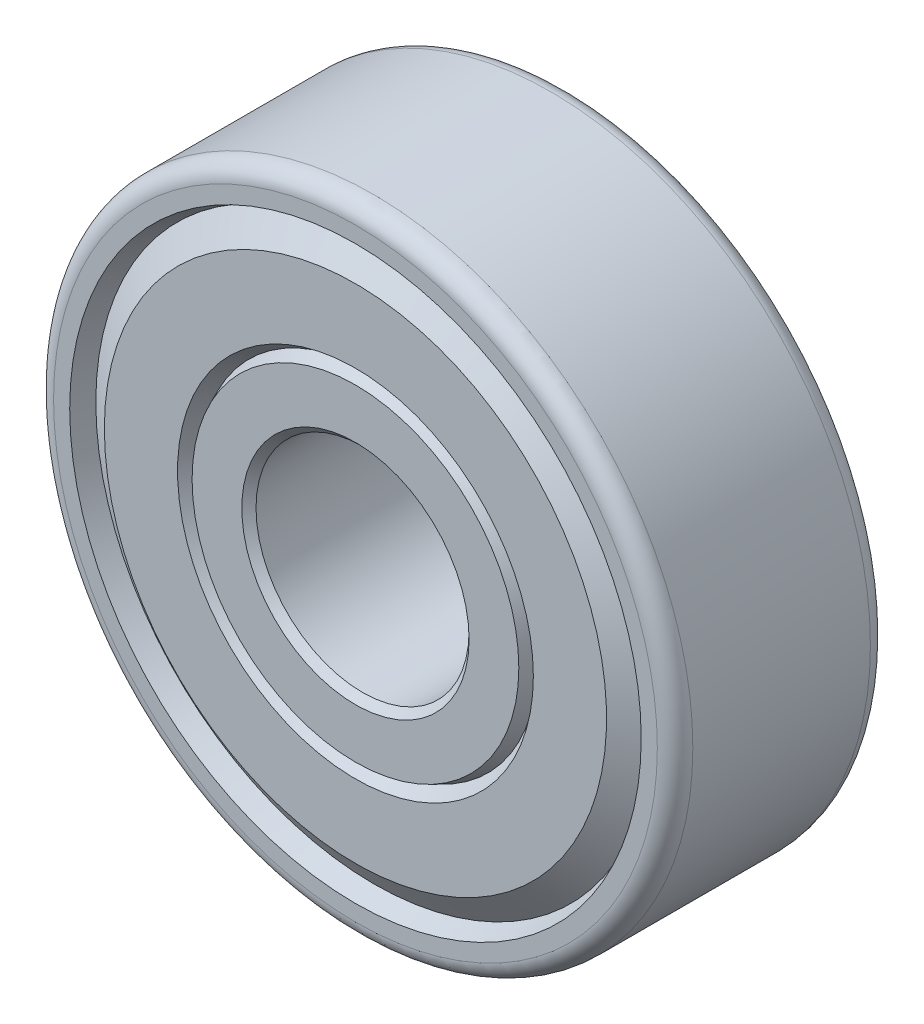
ISO-10303-21;
HEADER;
FILE_DESCRIPTION(('STEP AP214'),'2;1');
FILE_NAME('part.step','',(''),(''),'','','');
FILE_SCHEMA(('AUTOMOTIVE_DESIGN { 1 0 10303 214 1 1 1 1 }'));
ENDSEC;
DATA;
#1=APPLICATION_CONTEXT('core data for automotive mechanical design processes');
#2=APPLICATION_PROTOCOL_DEFINITION('international standard','automotive_design',2000,#1);
#3=PRODUCT_CONTEXT('',#1,'mechanical');
#4=PRODUCT('Part','Part','',(#3));
#5=PRODUCT_RELATED_PRODUCT_CATEGORY('part','',(#4));
#6=PRODUCT_DEFINITION_FORMATION('','',#4);
#7=PRODUCT_DEFINITION_CONTEXT('part definition',#1,'design');
#8=PRODUCT_DEFINITION('design','',#6,#7);
#9=PRODUCT_DEFINITION_SHAPE('','',#8);
#10=(LENGTH_UNIT() NAMED_UNIT(*) SI_UNIT(.MILLI.,.METRE.));
#11=(NAMED_UNIT(*) PLANE_ANGLE_UNIT() SI_UNIT($,.RADIAN.));
#12=(NAMED_UNIT(*) SI_UNIT($,.STERADIAN.) SOLID_ANGLE_UNIT());
#13=UNCERTAINTY_MEASURE_WITH_UNIT(LENGTH_MEASURE(1.E-05),#10,'distance_accuracy_value','');
#14=(GEOMETRIC_REPRESENTATION_CONTEXT(3) GLOBAL_UNCERTAINTY_ASSIGNED_CONTEXT((#13)) GLOBAL_UNIT_ASSIGNED_CONTEXT((#10,
#11,#12)) REPRESENTATION_CONTEXT('',''));
#15=CARTESIAN_POINT('',(0.,0.,0.));
#16=DIRECTION('',(0.,0.,1.));
#17=DIRECTION('',(1.,0.,0.));
#18=AXIS2_PLACEMENT_3D('',#15,#16,#17);
#19=CARTESIAN_POINT('',(0.,0.,0.));
#20=DIRECTION('',(0.,0.,1.));
#21=DIRECTION('',(1.,0.,0.));
#22=AXIS2_PLACEMENT_3D('',#19,#20,#21);
#23=CYLINDRICAL_SURFACE('',#22,4.7625);
#24=CARTESIAN_POINT('',(0.,0.,-4.44499999986192));
#25=DIRECTION('',(0.,0.,-1.));
#26=DIRECTION('',(-1.,0.,0.));
#27=AXIS2_PLACEMENT_3D('',#24,#25,#26);
#28=CIRCLE('',#27,4.76250000008349);
#29=CARTESIAN_POINT('',(-4.76250000008349,0.,-4.44499999986192));
#30=VERTEX_POINT('',#29);
#31=EDGE_CURVE('E337',#30,#30,#28,.T.);
#32=ORIENTED_EDGE('',*,*,#31,.T.);
#33=EDGE_LOOP('',(#32));
#34=FACE_BOUND('',#33,.T.);
#35=CARTESIAN_POINT('',(0.,0.,4.44499999986192));
#36=DIRECTION('',(0.,0.,1.));
#37=DIRECTION('',(-1.,0.,0.));
#38=AXIS2_PLACEMENT_3D('',#35,#36,#37);
#39=CIRCLE('',#38,4.76250000008349);
#40=CARTESIAN_POINT('',(-4.76250000008349,0.,4.44499999986192));
#41=VERTEX_POINT('',#40);
#42=EDGE_CURVE('E340',#41,#41,#39,.T.);
#43=ORIENTED_EDGE('',*,*,#42,.T.);
#44=EDGE_LOOP('',(#43));
#45=FACE_BOUND('',#44,.T.);
#46=ADVANCED_FACE('F16',(#34,#45),#23,.F.);
#47=CARTESIAN_POINT('',(0.,0.,-4.7624999999698));
#48=DIRECTION('',(0.,0.,-1.));
#49=DIRECTION('',(-1.,0.,0.));
#50=AXIS2_PLACEMENT_3D('',#47,#48,#49);
#51=CONICAL_SURFACE('',#50,5.07999999962294,0.785398162502276);
#52=CARTESIAN_POINT('',(0.,0.,-4.76250000008349));
#53=DIRECTION('',(0.,0.,-1.));
#54=DIRECTION('',(-1.,0.,0.));
#55=AXIS2_PLACEMENT_3D('',#52,#53,#54);
#56=CIRCLE('',#55,5.07999999973663);
#57=CARTESIAN_POINT('',(-5.07999999973663,0.,-4.76250000008349));
#58=VERTEX_POINT('',#57);
#59=EDGE_CURVE('E341',#58,#58,#56,.F.);
#60=ORIENTED_EDGE('',*,*,#59,.F.);
#61=EDGE_LOOP('',(#60));
#62=FACE_BOUND('',#61,.T.);
#63=ORIENTED_EDGE('',*,*,#31,.F.);
#64=EDGE_LOOP('',(#63));
#65=FACE_BOUND('',#64,.T.);
#66=ADVANCED_FACE('F262',(#62,#65),#51,.F.);
#67=CARTESIAN_POINT('',(0.,0.,4.7624999999698));
#68=DIRECTION('',(0.,0.,1.));
#69=DIRECTION('',(1.,0.,0.));
#70=AXIS2_PLACEMENT_3D('',#67,#68,#69);
#71=CONICAL_SURFACE('',#70,5.07999999962294,0.785398162502276);
#72=ORIENTED_EDGE('',*,*,#42,.F.);
#73=EDGE_LOOP('',(#72));
#74=FACE_BOUND('',#73,.T.);
#75=CARTESIAN_POINT('',(0.,0.,4.76250000008349));
#76=DIRECTION('',(0.,0.,1.));
#77=DIRECTION('',(1.,0.,0.));
#78=AXIS2_PLACEMENT_3D('',#75,#76,#77);
#79=CIRCLE('',#78,5.07999999973663);
#80=CARTESIAN_POINT('',(5.07999999973663,0.,4.76250000008349));
#81=VERTEX_POINT('',#80);
#82=EDGE_CURVE('E346',#81,#81,#79,.T.);
#83=ORIENTED_EDGE('',*,*,#82,.T.);
#84=EDGE_LOOP('',(#83));
#85=FACE_BOUND('',#84,.T.);
#86=ADVANCED_FACE('F254',(#74,#85),#71,.F.);
#87=CARTESIAN_POINT('',(0.,0.,-4.7625));
#88=DIRECTION('',(0.,0.,-1.));
#89=DIRECTION('',(-1.,0.,0.));
#90=AXIS2_PLACEMENT_3D('',#87,#88,#89);
#91=PLANE('',#90);
#92=ORIENTED_EDGE('',*,*,#59,.T.);
#93=EDGE_LOOP('',(#92));
#94=FACE_BOUND('',#93,.T.);
#95=CARTESIAN_POINT('',(0.,0.,-4.7625));
#96=DIRECTION('',(0.,0.,1.));
#97=DIRECTION('',(1.,0.,0.));
#98=AXIS2_PLACEMENT_3D('',#95,#96,#97);
#99=CIRCLE('',#98,7.3025);
#100=CARTESIAN_POINT('',(7.3025,0.,-4.7625));
#101=VERTEX_POINT('',#100);
#102=EDGE_CURVE('E384',#101,#101,#99,.T.);
#103=ORIENTED_EDGE('',*,*,#102,.F.);
#104=EDGE_LOOP('',(#103));
#105=FACE_BOUND('',#104,.T.);
#106=ADVANCED_FACE('F246',(#94,#105),#91,.T.);
#107=CARTESIAN_POINT('',(0.,0.,4.7625));
#108=DIRECTION('',(0.,0.,-1.));
#109=DIRECTION('',(-1.,0.,0.));
#110=AXIS2_PLACEMENT_3D('',#107,#108,#109);
#111=PLANE('',#110);
#112=ORIENTED_EDGE('',*,*,#82,.F.);
#113=EDGE_LOOP('',(#112));
#114=FACE_BOUND('',#113,.T.);
#115=CARTESIAN_POINT('',(0.,0.,4.76250000005854));
#116=DIRECTION('',(0.,0.,-1.));
#117=DIRECTION('',(-1.,0.,0.));
#118=AXIS2_PLACEMENT_3D('',#115,#116,#117);
#119=CIRCLE('',#118,7.30250000013546);
#120=CARTESIAN_POINT('',(-7.30250000013546,0.,4.76250000005854));
#121=VERTEX_POINT('',#120);
#122=EDGE_CURVE('E380',#121,#121,#119,.T.);
#123=ORIENTED_EDGE('',*,*,#122,.F.);
#124=EDGE_LOOP('',(#123));
#125=FACE_BOUND('',#124,.T.);
#126=ADVANCED_FACE('F238',(#114,#125),#111,.F.);
#127=CARTESIAN_POINT('',(0.,0.,-4.18132890087755));
#128=DIRECTION('',(0.,0.,1.));
#129=DIRECTION('',(1.,0.,0.));
#130=AXIS2_PLACEMENT_3D('',#127,#128,#129);
#131=CONICAL_SURFACE('',#130,7.55365742462336,0.407917424824535);
#132=CARTESIAN_POINT('',(0.,0.,-4.18132890087755));
#133=DIRECTION('',(0.,0.,-1.));
#134=DIRECTION('',(-1.,0.,0.));
#135=AXIS2_PLACEMENT_3D('',#132,#133,#134);
#136=CIRCLE('',#135,7.55365742462337);
#137=CARTESIAN_POINT('',(-7.55365742462337,0.,-4.18132890087755));
#138=VERTEX_POINT('',#137);
#139=EDGE_CURVE('E351',#138,#138,#136,.T.);
#140=ORIENTED_EDGE('',*,*,#139,.T.);
#141=EDGE_LOOP('',(#140));
#142=FACE_BOUND('',#141,.T.);
#143=ORIENTED_EDGE('',*,*,#102,.T.);
#144=EDGE_LOOP('',(#143));
#145=FACE_BOUND('',#144,.T.);
#146=ADVANCED_FACE('F230',(#142,#145),#131,.T.);
#147=CARTESIAN_POINT('',(0.,0.,4.18132890087755));
#148=DIRECTION('',(0.,0.,-1.));
#149=DIRECTION('',(-1.,0.,0.));
#150=AXIS2_PLACEMENT_3D('',#147,#148,#149);
#151=CONICAL_SURFACE('',#150,7.55365742446263,0.407917424358415);
#152=CARTESIAN_POINT('',(0.,0.,4.18132890066575));
#153=DIRECTION('',(0.,0.,1.));
#154=DIRECTION('',(-1.,0.,0.));
#155=AXIS2_PLACEMENT_3D('',#152,#153,#154);
#156=CIRCLE('',#155,7.55365742477154);
#157=CARTESIAN_POINT('',(-7.55365742477154,0.,4.18132890066575));
#158=VERTEX_POINT('',#157);
#159=EDGE_CURVE('E379',#158,#158,#156,.T.);
#160=ORIENTED_EDGE('',*,*,#159,.T.);
#161=EDGE_LOOP('',(#160));
#162=FACE_BOUND('',#161,.T.);
#163=ORIENTED_EDGE('',*,*,#122,.T.);
#164=EDGE_LOOP('',(#163));
#165=FACE_BOUND('',#164,.T.);
#166=ADVANCED_FACE('F222',(#162,#165),#151,.T.);
#167=CARTESIAN_POINT('',(0.,0.,-4.7625));
#168=DIRECTION('',(0.,0.,-1.));
#169=DIRECTION('',(-1.,0.,0.));
#170=AXIS2_PLACEMENT_3D('',#167,#168,#169);
#171=CONICAL_SURFACE('',#170,7.952136972928,0.601029540804804);
#172=ORIENTED_EDGE('',*,*,#139,.F.);
#173=EDGE_LOOP('',(#172));
#174=FACE_BOUND('',#173,.T.);
#175=CARTESIAN_POINT('',(0.,0.,-4.7625));
#176=DIRECTION('',(0.,0.,-1.));
#177=DIRECTION('',(-1.,0.,0.));
#178=AXIS2_PLACEMENT_3D('',#175,#176,#177);
#179=CIRCLE('',#178,7.952136972928);
#180=CARTESIAN_POINT('',(-7.952136972928,0.,-4.7625));
#181=VERTEX_POINT('',#180);
#182=EDGE_CURVE('E375',#181,#181,#179,.F.);
#183=ORIENTED_EDGE('',*,*,#182,.F.);
#184=EDGE_LOOP('',(#183));
#185=FACE_BOUND('',#184,.T.);
#186=ADVANCED_FACE('F214',(#174,#185),#171,.F.);
#187=CARTESIAN_POINT('',(0.,0.,4.7625));
#188=DIRECTION('',(0.,0.,1.));
#189=DIRECTION('',(1.,0.,0.));
#190=AXIS2_PLACEMENT_3D('',#187,#188,#189);
#191=CONICAL_SURFACE('',#190,7.95213697263462,0.601029540118035);
#192=CARTESIAN_POINT('',(0.,0.,4.7625));
#193=DIRECTION('',(0.,0.,1.));
#194=DIRECTION('',(1.,0.,0.));
#195=AXIS2_PLACEMENT_3D('',#192,#193,#194);
#196=CIRCLE('',#195,7.95213697263462);
#197=CARTESIAN_POINT('',(7.95213697263462,0.,4.7625));
#198=VERTEX_POINT('',#197);
#199=EDGE_CURVE('E371',#198,#198,#196,.T.);
#200=ORIENTED_EDGE('',*,*,#199,.T.);
#201=EDGE_LOOP('',(#200));
#202=FACE_BOUND('',#201,.T.);
#203=ORIENTED_EDGE('',*,*,#159,.F.);
#204=EDGE_LOOP('',(#203));
#205=FACE_BOUND('',#204,.T.);
#206=ADVANCED_FACE('F206',(#202,#205),#191,.F.);
#207=CARTESIAN_POINT('',(0.,0.,-4.7625));
#208=DIRECTION('',(0.,0.,-1.));
#209=DIRECTION('',(-1.,0.,0.));
#210=AXIS2_PLACEMENT_3D('',#207,#208,#209);
#211=PLANE('',#210);
#212=ORIENTED_EDGE('',*,*,#182,.T.);
#213=EDGE_LOOP('',(#212));
#214=FACE_BOUND('',#213,.T.);
#215=CARTESIAN_POINT('',(0.,0.,-4.7625));
#216=DIRECTION('',(0.,0.,1.));
#217=DIRECTION('',(1.,0.,0.));
#218=AXIS2_PLACEMENT_3D('',#215,#216,#217);
#219=CIRCLE('',#218,11.2241326943492);
#220=CARTESIAN_POINT('',(11.2241326943492,0.,-4.7625));
#221=VERTEX_POINT('',#220);
#222=EDGE_CURVE('E367',#221,#221,#219,.T.);
#223=ORIENTED_EDGE('',*,*,#222,.F.);
#224=EDGE_LOOP('',(#223));
#225=FACE_BOUND('',#224,.T.);
#226=ADVANCED_FACE('F199',(#214,#225),#211,.T.);
#227=CARTESIAN_POINT('',(0.,0.,4.7625));
#228=DIRECTION('',(0.,0.,-1.));
#229=DIRECTION('',(-1.,0.,0.));
#230=AXIS2_PLACEMENT_3D('',#227,#228,#229);
#231=PLANE('',#230);
#232=ORIENTED_EDGE('',*,*,#199,.F.);
#233=EDGE_LOOP('',(#232));
#234=FACE_BOUND('',#233,.T.);
#235=CARTESIAN_POINT('',(0.,0.,4.76250000067259));
#236=DIRECTION('',(0.,0.,-1.));
#237=DIRECTION('',(-1.,0.,0.));
#238=AXIS2_PLACEMENT_3D('',#235,#236,#237);
#239=CIRCLE('',#238,11.2241326948103);
#240=CARTESIAN_POINT('',(-11.2241326948103,0.,4.76250000067259));
#241=VERTEX_POINT('',#240);
#242=EDGE_CURVE('E362',#241,#241,#239,.T.);
#243=ORIENTED_EDGE('',*,*,#242,.F.);
#244=EDGE_LOOP('',(#243));
#245=FACE_BOUND('',#244,.T.);
#246=ADVANCED_FACE('F190',(#234,#245),#231,.F.);
#247=CARTESIAN_POINT('',(0.,0.,-3.93017144225871));
#248=DIRECTION('',(0.,0.,1.));
#249=DIRECTION('',(1.,0.,0.));
#250=AXIS2_PLACEMENT_3D('',#247,#248,#249);
#251=CONICAL_SURFACE('',#250,12.4380602466955,0.969766785990084);
#252=CARTESIAN_POINT('',(0.,0.,-3.93017144225872));
#253=DIRECTION('',(0.,0.,-1.));
#254=DIRECTION('',(-1.,0.,0.));
#255=AXIS2_PLACEMENT_3D('',#252,#253,#254);
#256=CIRCLE('',#255,12.4380602466955);
#257=CARTESIAN_POINT('',(-12.4380602466955,0.,-3.93017144225872));
#258=VERTEX_POINT('',#257);
#259=EDGE_CURVE('E366',#258,#258,#256,.T.);
#260=ORIENTED_EDGE('',*,*,#259,.T.);
#261=EDGE_LOOP('',(#260));
#262=FACE_BOUND('',#261,.T.);
#263=ORIENTED_EDGE('',*,*,#222,.T.);
#264=EDGE_LOOP('',(#263));
#265=FACE_BOUND('',#264,.T.);
#266=ADVANCED_FACE('F182',(#262,#265),#251,.T.);
#267=CARTESIAN_POINT('',(0.,0.,3.93017144225871));
#268=DIRECTION('',(0.,0.,-1.));
#269=DIRECTION('',(-1.,0.,0.));
#270=AXIS2_PLACEMENT_3D('',#267,#268,#269);
#271=CONICAL_SURFACE('',#270,12.4380602452534,0.969766784881962);
#272=CARTESIAN_POINT('',(0.,0.,3.93017144168615));
#273=DIRECTION('',(0.,0.,1.));
#274=DIRECTION('',(-1.,0.,0.));
#275=AXIS2_PLACEMENT_3D('',#272,#273,#274);
#276=CIRCLE('',#275,12.4380602466765);
#277=CARTESIAN_POINT('',(-12.4380602466765,0.,3.93017144168615));
#278=VERTEX_POINT('',#277);
#279=EDGE_CURVE('E361',#278,#278,#276,.T.);
#280=ORIENTED_EDGE('',*,*,#279,.T.);
#281=EDGE_LOOP('',(#280));
#282=FACE_BOUND('',#281,.T.);
#283=ORIENTED_EDGE('',*,*,#242,.T.);
#284=EDGE_LOOP('',(#283));
#285=FACE_BOUND('',#284,.T.);
#286=ADVANCED_FACE('F174',(#282,#285),#271,.T.);
#287=CARTESIAN_POINT('',(0.,0.,-4.7625));
#288=DIRECTION('',(0.,0.,-1.));
#289=DIRECTION('',(-1.,0.,0.));
#290=AXIS2_PLACEMENT_3D('',#287,#288,#289);
#291=CONICAL_SURFACE('',#290,12.7729368128599,0.382519398268516);
#292=ORIENTED_EDGE('',*,*,#259,.F.);
#293=EDGE_LOOP('',(#292));
#294=FACE_BOUND('',#293,.T.);
#295=CARTESIAN_POINT('',(0.,0.,-4.7625));
#296=DIRECTION('',(0.,0.,-1.));
#297=DIRECTION('',(-1.,0.,0.));
#298=AXIS2_PLACEMENT_3D('',#295,#296,#297);
#299=CIRCLE('',#298,12.7729368128599);
#300=CARTESIAN_POINT('',(-12.7729368128599,0.,-4.7625));
#301=VERTEX_POINT('',#300);
#302=EDGE_CURVE('E357',#301,#301,#299,.F.);
#303=ORIENTED_EDGE('',*,*,#302,.F.);
#304=EDGE_LOOP('',(#303));
#305=FACE_BOUND('',#304,.T.);
#306=ADVANCED_FACE('F166',(#294,#305),#291,.F.);
#307=CARTESIAN_POINT('',(0.,0.,4.7625));
#308=DIRECTION('',(0.,0.,1.));
#309=DIRECTION('',(1.,0.,0.));
#310=AXIS2_PLACEMENT_3D('',#307,#308,#309);
#311=CONICAL_SURFACE('',#310,12.7729368126486,0.382519397831445);
#312=CARTESIAN_POINT('',(0.,0.,4.7625));
#313=DIRECTION('',(0.,0.,1.));
#314=DIRECTION('',(1.,0.,0.));
#315=AXIS2_PLACEMENT_3D('',#312,#313,#314);
#316=CIRCLE('',#315,12.7729368126486);
#317=CARTESIAN_POINT('',(12.7729368126486,0.,4.7625));
#318=VERTEX_POINT('',#317);
#319=EDGE_CURVE('E58',#318,#318,#316,.T.);
#320=ORIENTED_EDGE('',*,*,#319,.T.);
#321=EDGE_LOOP('',(#320));
#322=FACE_BOUND('',#321,.T.);
#323=ORIENTED_EDGE('',*,*,#279,.F.);
#324=EDGE_LOOP('',(#323));
#325=FACE_BOUND('',#324,.T.);
#326=ADVANCED_FACE('F159',(#322,#325),#311,.F.);
#327=CARTESIAN_POINT('',(0.,0.,-4.7625));
#328=DIRECTION('',(0.,0.,-1.));
#329=DIRECTION('',(-1.,0.,0.));
#330=AXIS2_PLACEMENT_3D('',#327,#328,#329);
#331=PLANE('',#330);
#332=ORIENTED_EDGE('',*,*,#302,.T.);
#333=EDGE_LOOP('',(#332));
#334=FACE_BOUND('',#333,.T.);
#335=CARTESIAN_POINT('',(0.,0.,-4.76249999999999));
#336=DIRECTION('',(0.,0.,1.));
#337=DIRECTION('',(1.,0.,0.));
#338=AXIS2_PLACEMENT_3D('',#335,#336,#337);
#339=CIRCLE('',#338,13.49375);
#340=CARTESIAN_POINT('',(13.49375,0.,-4.7625));
#341=VERTEX_POINT('',#340);
#342=CARTESIAN_POINT('',(-13.49375,0.,-4.7625));
#343=VERTEX_POINT('',#342);
#344=EDGE_CURVE('E50',#341,#343,#339,.T.);
#345=ORIENTED_EDGE('',*,*,#344,.F.);
#346=CARTESIAN_POINT('',(0.,0.,-4.76249999999999));
#347=DIRECTION('',(0.,0.,1.));
#348=DIRECTION('',(-1.,0.,0.));
#349=AXIS2_PLACEMENT_3D('',#346,#347,#348);
#350=CIRCLE('',#349,13.49375);
#351=EDGE_CURVE('E55',#343,#341,#350,.T.);
#352=ORIENTED_EDGE('',*,*,#351,.F.);
#353=EDGE_LOOP('',(#345,#352));
#354=FACE_BOUND('',#353,.T.);
#355=ADVANCED_FACE('F54',(#334,#354),#331,.T.);
#356=CARTESIAN_POINT('',(0.,0.,4.7625));
#357=DIRECTION('',(0.,0.,-1.));
#358=DIRECTION('',(-1.,0.,0.));
#359=AXIS2_PLACEMENT_3D('',#356,#357,#358);
#360=PLANE('',#359);
#361=ORIENTED_EDGE('',*,*,#319,.F.);
#362=EDGE_LOOP('',(#361));
#363=FACE_BOUND('',#362,.T.);
#364=CARTESIAN_POINT('',(0.,0.,4.76250000000002));
#365=DIRECTION('',(0.,0.,-1.));
#366=DIRECTION('',(1.,0.,0.));
#367=AXIS2_PLACEMENT_3D('',#364,#365,#366);
#368=CIRCLE('',#367,13.49375);
#369=CARTESIAN_POINT('',(13.49375,0.,4.76250000000001));
#370=VERTEX_POINT('',#369);
#371=CARTESIAN_POINT('',(-13.49375,0.,4.76250000000001));
#372=VERTEX_POINT('',#371);
#373=EDGE_CURVE('E64',#370,#372,#368,.T.);
#374=ORIENTED_EDGE('',*,*,#373,.F.);
#375=CARTESIAN_POINT('',(0.,0.,4.76250000000002));
#376=DIRECTION('',(0.,0.,-1.));
#377=DIRECTION('',(-1.,0.,0.));
#378=AXIS2_PLACEMENT_3D('',#375,#376,#377);
#379=CIRCLE('',#378,13.49375);
#380=EDGE_CURVE('E40',#372,#370,#379,.T.);
#381=ORIENTED_EDGE('',*,*,#380,.F.);
#382=EDGE_LOOP('',(#374,#381));
#383=FACE_BOUND('',#382,.T.);
#384=ADVANCED_FACE('F85',(#363,#383),#360,.F.);
#385=CARTESIAN_POINT('',(0.,0.,-3.96874999999999));
#386=DIRECTION('',(0.,0.,1.));
#387=DIRECTION('',(1.,0.,0.));
#388=AXIS2_PLACEMENT_3D('',#385,#386,#387);
#389=TOROIDAL_SURFACE('',#388,13.49375,0.79375);
#390=ORIENTED_EDGE('',*,*,#344,.T.);
#391=ORIENTED_EDGE('',*,*,#351,.T.);
#392=EDGE_LOOP('',(#390,#391));
#393=FACE_BOUND('',#392,.T.);
#394=CARTESIAN_POINT('',(0.,0.,-3.96874999999999));
#395=DIRECTION('',(0.,0.,1.));
#396=DIRECTION('',(1.,0.,0.));
#397=AXIS2_PLACEMENT_3D('',#394,#395,#396);
#398=CIRCLE('',#397,14.2875);
#399=CARTESIAN_POINT('',(14.2875,0.,-3.96874999999999));
#400=VERTEX_POINT('',#399);
#401=EDGE_CURVE('E28',#400,#400,#398,.T.);
#402=ORIENTED_EDGE('',*,*,#401,.F.);
#403=EDGE_LOOP('',(#402));
#404=FACE_BOUND('',#403,.T.);
#405=ADVANCED_FACE('F61',(#393,#404),#389,.T.);
#406=CARTESIAN_POINT('',(0.,0.,3.96875000000002));
#407=DIRECTION('',(0.,0.,-1.));
#408=DIRECTION('',(-1.,0.,0.));
#409=AXIS2_PLACEMENT_3D('',#406,#407,#408);
#410=TOROIDAL_SURFACE('',#409,13.49375,0.79375);
#411=ORIENTED_EDGE('',*,*,#380,.T.);
#412=ORIENTED_EDGE('',*,*,#373,.T.);
#413=EDGE_LOOP('',(#411,#412));
#414=FACE_BOUND('',#413,.T.);
#415=CARTESIAN_POINT('',(0.,0.,3.96875000000002));
#416=DIRECTION('',(0.,0.,1.));
#417=DIRECTION('',(1.,0.,0.));
#418=AXIS2_PLACEMENT_3D('',#415,#416,#417);
#419=CIRCLE('',#418,14.2875);
#420=CARTESIAN_POINT('',(14.2875,0.,3.96875000000002));
#421=VERTEX_POINT('',#420);
#422=EDGE_CURVE('E11',#421,#421,#419,.F.);
#423=ORIENTED_EDGE('',*,*,#422,.F.);
#424=EDGE_LOOP('',(#423));
#425=FACE_BOUND('',#424,.T.);
#426=ADVANCED_FACE('F84',(#414,#425),#410,.T.);
#427=CARTESIAN_POINT('',(0.,0.,0.));
#428=DIRECTION('',(0.,0.,1.));
#429=DIRECTION('',(1.,0.,0.));
#430=AXIS2_PLACEMENT_3D('',#427,#428,#429);
#431=CYLINDRICAL_SURFACE('',#430,14.2875);
#432=ORIENTED_EDGE('',*,*,#422,.T.);
#433=EDGE_LOOP('',(#432));
#434=FACE_BOUND('',#433,.T.);
#435=ORIENTED_EDGE('',*,*,#401,.T.);
#436=EDGE_LOOP('',(#435));
#437=FACE_BOUND('',#436,.T.);
#438=ADVANCED_FACE('F130',(#434,#437),#431,.T.);
#439=CLOSED_SHELL('',(#46,#66,#86,#106,#126,#146,#166,#186,#206,#226,#246,#266,#286,#306,#326,
#355,#384,#405,#426,#438));
#440=MANIFOLD_SOLID_BREP('B1',#439);
#441=ADVANCED_BREP_SHAPE_REPRESENTATION('',(#18,#440),#14);
#442=SHAPE_DEFINITION_REPRESENTATION(#9,#441);
ENDSEC;
END-ISO-10303-21;
